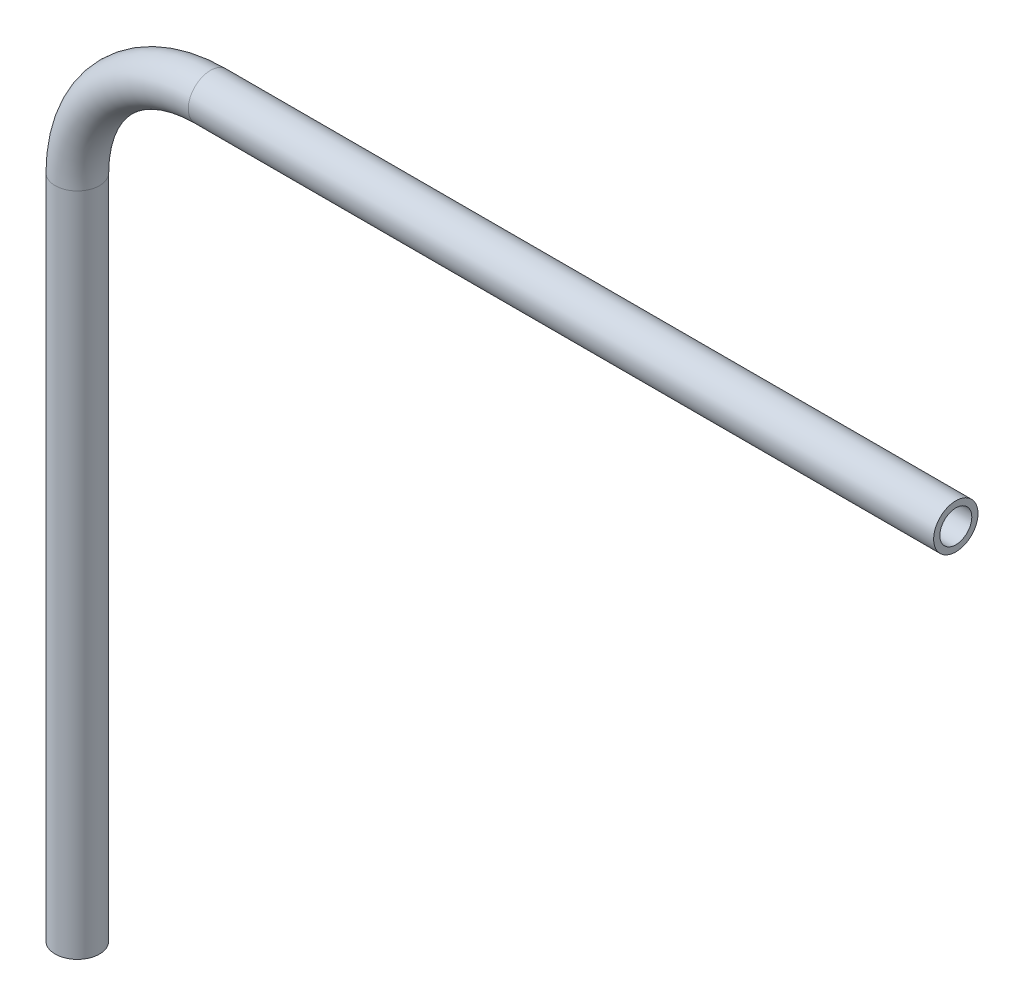
ISO-10303-21;
HEADER;
FILE_DESCRIPTION(('STEP AP214'),'2;1');
FILE_NAME('part.step','',(''),(''),'','','');
FILE_SCHEMA(('AUTOMOTIVE_DESIGN { 1 0 10303 214 1 1 1 1 }'));
ENDSEC;
DATA;
#1=APPLICATION_CONTEXT('core data for automotive mechanical design processes');
#2=APPLICATION_PROTOCOL_DEFINITION('international standard','automotive_design',2000,#1);
#3=PRODUCT_CONTEXT('',#1,'mechanical');
#4=PRODUCT('Part','Part','',(#3));
#5=PRODUCT_RELATED_PRODUCT_CATEGORY('part','',(#4));
#6=PRODUCT_DEFINITION_FORMATION('','',#4);
#7=PRODUCT_DEFINITION_CONTEXT('part definition',#1,'design');
#8=PRODUCT_DEFINITION('design','',#6,#7);
#9=PRODUCT_DEFINITION_SHAPE('','',#8);
#10=(LENGTH_UNIT() NAMED_UNIT(*) SI_UNIT(.MILLI.,.METRE.));
#11=(NAMED_UNIT(*) PLANE_ANGLE_UNIT() SI_UNIT($,.RADIAN.));
#12=(NAMED_UNIT(*) SI_UNIT($,.STERADIAN.) SOLID_ANGLE_UNIT());
#13=UNCERTAINTY_MEASURE_WITH_UNIT(LENGTH_MEASURE(1.E-05),#10,'distance_accuracy_value','');
#14=(GEOMETRIC_REPRESENTATION_CONTEXT(3) GLOBAL_UNCERTAINTY_ASSIGNED_CONTEXT((#13)) GLOBAL_UNIT_ASSIGNED_CONTEXT((#10,
#11,#12)) REPRESENTATION_CONTEXT('',''));
#15=CARTESIAN_POINT('',(0.,0.,0.));
#16=DIRECTION('',(0.,0.,1.));
#17=DIRECTION('',(1.,0.,0.));
#18=AXIS2_PLACEMENT_3D('',#15,#16,#17);
#19=CARTESIAN_POINT('',(0.,-96.7723178807947,0.));
#20=DIRECTION('',(0.,1.,0.));
#21=DIRECTION('',(0.,0.,1.));
#22=AXIS2_PLACEMENT_3D('',#19,#20,#21);
#23=CYLINDRICAL_SURFACE('',#22,3.175);
#24=CARTESIAN_POINT('',(0.,-1.52231788079482,0.));
#25=DIRECTION('',(0.,1.,0.));
#26=DIRECTION('',(0.,0.,-1.));
#27=AXIS2_PLACEMENT_3D('',#24,#25,#26);
#28=CIRCLE('',#27,3.175);
#29=CARTESIAN_POINT('',(-3.175,-1.52231788079484,0.));
#30=VERTEX_POINT('',#29);
#31=EDGE_CURVE('E80',#30,#30,#28,.T.);
#32=ORIENTED_EDGE('',*,*,#31,.F.);
#33=EDGE_LOOP('',(#32));
#34=FACE_BOUND('',#33,.T.);
#35=CARTESIAN_POINT('',(0.,-96.7723178807947,0.));
#36=DIRECTION('',(0.,1.,0.));
#37=DIRECTION('',(0.,0.,-1.));
#38=AXIS2_PLACEMENT_3D('',#35,#36,#37);
#39=CIRCLE('',#38,3.175);
#40=CARTESIAN_POINT('',(0.,-96.7723178807947,-3.175));
#41=VERTEX_POINT('',#40);
#42=EDGE_CURVE('E49',#41,#41,#39,.T.);
#43=ORIENTED_EDGE('',*,*,#42,.T.);
#44=EDGE_LOOP('',(#43));
#45=FACE_BOUND('',#44,.T.);
#46=ADVANCED_FACE('F34',(#34,#45),#23,.T.);
#47=CARTESIAN_POINT('',(19.05,-1.52231788079469,0.));
#48=DIRECTION('',(0.,0.,-1.));
#49=DIRECTION('',(-1.,0.,0.));
#50=AXIS2_PLACEMENT_3D('',#47,#48,#49);
#51=TOROIDAL_SURFACE('',#50,19.05,3.175);
#52=CARTESIAN_POINT('',(19.05,17.5276821192062,0.));
#53=DIRECTION('',(1.,0.,0.));
#54=DIRECTION('',(0.,0.,-1.));
#55=AXIS2_PLACEMENT_3D('',#52,#53,#54);
#56=CIRCLE('',#55,3.175);
#57=CARTESIAN_POINT('',(19.05,20.7026821192053,0.));
#58=VERTEX_POINT('',#57);
#59=EDGE_CURVE('E38',#58,#58,#56,.T.);
#60=CARTESIAN_POINT('',(19.05,-1.52231788079469,0.));
#61=DIRECTION('',(0.,0.,-1.));
#62=DIRECTION('',(-1.,0.,0.));
#63=AXIS2_PLACEMENT_3D('',#60,#61,#62);
#64=CIRCLE('',#63,22.225);
#65=EDGE_CURVE('',#30,#58,#64,.T.);
#66=ORIENTED_EDGE('',*,*,#31,.T.);
#67=ORIENTED_EDGE('',*,*,#59,.F.);
#68=ORIENTED_EDGE('',*,*,#65,.T.);
#69=ORIENTED_EDGE('',*,*,#65,.F.);
#70=EDGE_LOOP('',(#66,#68,#67,#69));
#71=FACE_BOUND('',#70,.T.);
#72=ADVANCED_FACE('F88',(#71),#51,.T.);
#73=CARTESIAN_POINT('',(19.0500000000001,17.5276821192053,0.));
#74=DIRECTION('',(1.,0.,0.));
#75=DIRECTION('',(0.,0.,-1.));
#76=AXIS2_PLACEMENT_3D('',#73,#74,#75);
#77=CYLINDRICAL_SURFACE('',#76,3.175);
#78=CARTESIAN_POINT('',(125.73,17.5276821192053,0.));
#79=DIRECTION('',(1.,0.,0.));
#80=DIRECTION('',(0.,0.,-1.));
#81=AXIS2_PLACEMENT_3D('',#78,#79,#80);
#82=CIRCLE('',#81,3.175);
#83=CARTESIAN_POINT('',(125.73,17.5276821192053,-3.175));
#84=VERTEX_POINT('',#83);
#85=EDGE_CURVE('E54',#84,#84,#82,.T.);
#86=ORIENTED_EDGE('',*,*,#85,.F.);
#87=EDGE_LOOP('',(#86));
#88=FACE_BOUND('',#87,.T.);
#89=ORIENTED_EDGE('',*,*,#59,.T.);
#90=EDGE_LOOP('',(#89));
#91=FACE_BOUND('',#90,.T.);
#92=ADVANCED_FACE('F36',(#88,#91),#77,.T.);
#93=CARTESIAN_POINT('',(0.,-96.7723178807947,0.));
#94=DIRECTION('',(0.,1.,0.));
#95=DIRECTION('',(0.,0.,-1.));
#96=AXIS2_PLACEMENT_3D('',#93,#94,#95);
#97=PLANE('',#96);
#98=CARTESIAN_POINT('',(0.,-96.7723178807947,0.));
#99=DIRECTION('',(0.,1.,0.));
#100=DIRECTION('',(0.,0.,-1.));
#101=AXIS2_PLACEMENT_3D('',#98,#99,#100);
#102=CIRCLE('',#101,2.286);
#103=CARTESIAN_POINT('',(0.,-96.7723178807947,-2.286));
#104=VERTEX_POINT('',#103);
#105=EDGE_CURVE('E75',#104,#104,#102,.F.);
#106=ORIENTED_EDGE('',*,*,#105,.F.);
#107=EDGE_LOOP('',(#106));
#108=FACE_BOUND('',#107,.T.);
#109=ORIENTED_EDGE('',*,*,#42,.F.);
#110=EDGE_LOOP('',(#109));
#111=FACE_BOUND('',#110,.T.);
#112=ADVANCED_FACE('F94',(#108,#111),#97,.F.);
#113=CARTESIAN_POINT('',(125.73,17.5276821192053,0.));
#114=DIRECTION('',(1.,0.,0.));
#115=DIRECTION('',(0.,0.,-1.));
#116=AXIS2_PLACEMENT_3D('',#113,#114,#115);
#117=PLANE('',#116);
#118=CARTESIAN_POINT('',(125.73,17.5276821192053,0.));
#119=DIRECTION('',(1.,0.,0.));
#120=DIRECTION('',(0.,0.,-1.));
#121=AXIS2_PLACEMENT_3D('',#118,#119,#120);
#122=CIRCLE('',#121,2.286);
#123=CARTESIAN_POINT('',(125.73,17.5276821192053,-2.286));
#124=VERTEX_POINT('',#123);
#125=EDGE_CURVE('E11',#124,#124,#122,.F.);
#126=ORIENTED_EDGE('',*,*,#125,.T.);
#127=EDGE_LOOP('',(#126));
#128=FACE_BOUND('',#127,.T.);
#129=ORIENTED_EDGE('',*,*,#85,.T.);
#130=EDGE_LOOP('',(#129));
#131=FACE_BOUND('',#130,.T.);
#132=ADVANCED_FACE('F61',(#128,#131),#117,.T.);
#133=CARTESIAN_POINT('',(0.,-96.7723178807947,0.));
#134=DIRECTION('',(0.,1.,0.));
#135=DIRECTION('',(0.,0.,1.));
#136=AXIS2_PLACEMENT_3D('',#133,#134,#135);
#137=CYLINDRICAL_SURFACE('',#136,2.286);
#138=CARTESIAN_POINT('',(0.,-1.52231788079482,0.));
#139=DIRECTION('',(0.,1.,0.));
#140=DIRECTION('',(0.,0.,-1.));
#141=AXIS2_PLACEMENT_3D('',#138,#139,#140);
#142=CIRCLE('',#141,2.286);
#143=CARTESIAN_POINT('',(-2.286,-1.52231788079484,0.));
#144=VERTEX_POINT('',#143);
#145=EDGE_CURVE('E72',#144,#144,#142,.F.);
#146=ORIENTED_EDGE('',*,*,#145,.F.);
#147=EDGE_LOOP('',(#146));
#148=FACE_BOUND('',#147,.T.);
#149=ORIENTED_EDGE('',*,*,#105,.T.);
#150=EDGE_LOOP('',(#149));
#151=FACE_BOUND('',#150,.T.);
#152=ADVANCED_FACE('F102',(#148,#151),#137,.F.);
#153=CARTESIAN_POINT('',(19.05,-1.52231788079469,0.));
#154=DIRECTION('',(0.,0.,-1.));
#155=DIRECTION('',(-1.,0.,0.));
#156=AXIS2_PLACEMENT_3D('',#153,#154,#155);
#157=TOROIDAL_SURFACE('',#156,19.05,2.286);
#158=CARTESIAN_POINT('',(19.05,17.5276821192062,0.));
#159=DIRECTION('',(1.,0.,0.));
#160=DIRECTION('',(0.,0.,-1.));
#161=AXIS2_PLACEMENT_3D('',#158,#159,#160);
#162=CIRCLE('',#161,2.286);
#163=CARTESIAN_POINT('',(19.05,19.8136821192053,0.));
#164=VERTEX_POINT('',#163);
#165=EDGE_CURVE('E43',#164,#164,#162,.F.);
#166=CARTESIAN_POINT('',(19.05,-1.52231788079469,0.));
#167=DIRECTION('',(0.,0.,-1.));
#168=DIRECTION('',(-1.,0.,0.));
#169=AXIS2_PLACEMENT_3D('',#166,#167,#168);
#170=CIRCLE('',#169,21.336);
#171=EDGE_CURVE('',#144,#164,#170,.T.);
#172=ORIENTED_EDGE('',*,*,#145,.T.);
#173=ORIENTED_EDGE('',*,*,#165,.F.);
#174=ORIENTED_EDGE('',*,*,#171,.T.);
#175=ORIENTED_EDGE('',*,*,#171,.F.);
#176=EDGE_LOOP('',(#172,#174,#173,#175));
#177=FACE_BOUND('',#176,.T.);
#178=ADVANCED_FACE('F67',(#177),#157,.F.);
#179=CARTESIAN_POINT('',(19.0500000000001,17.5276821192053,0.));
#180=DIRECTION('',(1.,0.,0.));
#181=DIRECTION('',(0.,0.,-1.));
#182=AXIS2_PLACEMENT_3D('',#179,#180,#181);
#183=CYLINDRICAL_SURFACE('',#182,2.286);
#184=ORIENTED_EDGE('',*,*,#125,.F.);
#185=EDGE_LOOP('',(#184));
#186=FACE_BOUND('',#185,.T.);
#187=ORIENTED_EDGE('',*,*,#165,.T.);
#188=EDGE_LOOP('',(#187));
#189=FACE_BOUND('',#188,.T.);
#190=ADVANCED_FACE('F64',(#186,#189),#183,.F.);
#191=CLOSED_SHELL('',(#46,#72,#92,#112,#132,#152,#178,#190));
#192=MANIFOLD_SOLID_BREP('B2',#191);
#193=ADVANCED_BREP_SHAPE_REPRESENTATION('',(#18,#192),#14);
#194=SHAPE_DEFINITION_REPRESENTATION(#9,#193);
ENDSEC;
END-ISO-10303-21;
